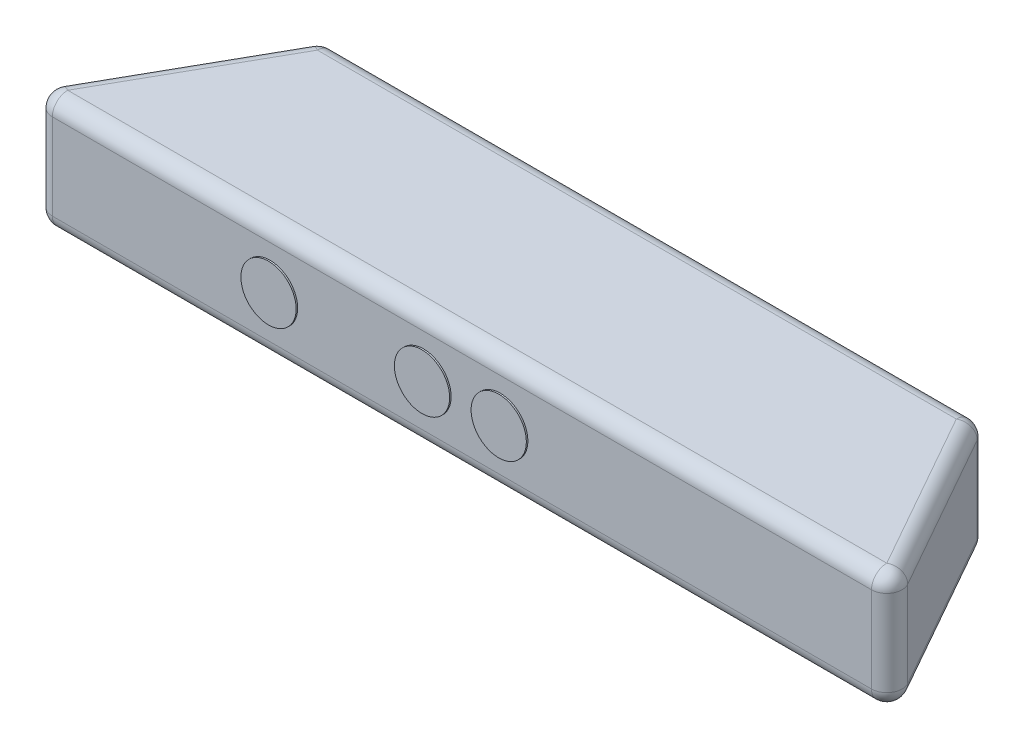
ISO-10303-21;
HEADER;
FILE_DESCRIPTION(('STEP AP214'),'2;1');
FILE_NAME('part.step','',(''),(''),'','','');
FILE_SCHEMA(('AUTOMOTIVE_DESIGN { 1 0 10303 214 1 1 1 1 }'));
ENDSEC;
DATA;
#1=APPLICATION_CONTEXT('core data for automotive mechanical design processes');
#2=APPLICATION_PROTOCOL_DEFINITION('international standard','automotive_design',2000,#1);
#3=PRODUCT_CONTEXT('',#1,'mechanical');
#4=PRODUCT('Part','Part','',(#3));
#5=PRODUCT_RELATED_PRODUCT_CATEGORY('part','',(#4));
#6=PRODUCT_DEFINITION_FORMATION('','',#4);
#7=PRODUCT_DEFINITION_CONTEXT('part definition',#1,'design');
#8=PRODUCT_DEFINITION('design','',#6,#7);
#9=PRODUCT_DEFINITION_SHAPE('','',#8);
#10=(LENGTH_UNIT() NAMED_UNIT(*) SI_UNIT(.MILLI.,.METRE.));
#11=(NAMED_UNIT(*) PLANE_ANGLE_UNIT() SI_UNIT($,.RADIAN.));
#12=(NAMED_UNIT(*) SI_UNIT($,.STERADIAN.) SOLID_ANGLE_UNIT());
#13=UNCERTAINTY_MEASURE_WITH_UNIT(LENGTH_MEASURE(1.E-05),#10,'distance_accuracy_value','');
#14=(GEOMETRIC_REPRESENTATION_CONTEXT(3) GLOBAL_UNCERTAINTY_ASSIGNED_CONTEXT((#13)) GLOBAL_UNIT_ASSIGNED_CONTEXT((#10,
#11,#12)) REPRESENTATION_CONTEXT('',''));
#15=CARTESIAN_POINT('',(0.,0.,0.));
#16=DIRECTION('',(0.,0.,1.));
#17=DIRECTION('',(1.,0.,0.));
#18=AXIS2_PLACEMENT_3D('',#15,#16,#17);
#19=CARTESIAN_POINT('',(-142.,0.,0.));
#20=DIRECTION('',(0.,1.,0.));
#21=DIRECTION('',(0.,0.,1.));
#22=AXIS2_PLACEMENT_3D('',#19,#20,#21);
#23=PLANE('',#22);
#24=CARTESIAN_POINT('',(97.,0.,-17.5000000000002));
#25=DIRECTION('',(0.,-1.,0.));
#26=DIRECTION('',(0.,0.,1.));
#27=AXIS2_PLACEMENT_3D('',#24,#25,#26);
#28=CIRCLE('',#27,3.00000000000001);
#29=CARTESIAN_POINT('',(97.,0.,-14.5000000000001));
#30=VERTEX_POINT('',#29);
#31=EDGE_CURVE('E604',#30,#30,#28,.T.);
#32=ORIENTED_EDGE('',*,*,#31,.F.);
#33=EDGE_LOOP('',(#32));
#34=FACE_BOUND('',#33,.T.);
#35=CARTESIAN_POINT('',(-97.,0.,-17.5));
#36=DIRECTION('',(0.,-1.,0.));
#37=DIRECTION('',(0.,0.,-1.));
#38=AXIS2_PLACEMENT_3D('',#35,#36,#37);
#39=CIRCLE('',#38,3.00000000000001);
#40=CARTESIAN_POINT('',(-97.,0.,-20.5));
#41=VERTEX_POINT('',#40);
#42=EDGE_CURVE('E597',#41,#41,#39,.T.);
#43=ORIENTED_EDGE('',*,*,#42,.F.);
#44=EDGE_LOOP('',(#43));
#45=FACE_BOUND('',#44,.T.);
#46=DIRECTION('',(1.,0.,0.));
#47=VECTOR('',#46,1.);
#48=CARTESIAN_POINT('',(-142.,0.,-5.));
#49=LINE('',#48,#47);
#50=CARTESIAN_POINT('',(133.435733060862,0.,-5.));
#51=VERTEX_POINT('',#50);
#52=CARTESIAN_POINT('',(-133.435733060862,0.,-5.));
#53=VERTEX_POINT('',#52);
#54=EDGE_CURVE('E233',#51,#53,#49,.F.);
#55=ORIENTED_EDGE('',*,*,#54,.T.);
#56=DIRECTION('',(-0.491594368038244,0.,0.870824309096318));
#57=VECTOR('',#56,1.);
#58=CARTESIAN_POINT('',(-137.645878454518,0.,2.45797184019122));
#59=LINE('',#58,#57);
#60=CARTESIAN_POINT('',(-104.080894351185,0.,-57.));
#61=VERTEX_POINT('',#60);
#62=EDGE_CURVE('E242',#53,#61,#59,.F.);
#63=ORIENTED_EDGE('',*,*,#62,.T.);
#64=DIRECTION('',(-1.,0.,0.));
#65=VECTOR('',#64,1.);
#66=CARTESIAN_POINT('',(-142.,0.,-57.));
#67=LINE('',#66,#65);
#68=CARTESIAN_POINT('',(104.080894351185,0.,-57.));
#69=VERTEX_POINT('',#68);
#70=EDGE_CURVE('E239',#61,#69,#67,.F.);
#71=ORIENTED_EDGE('',*,*,#70,.T.);
#72=DIRECTION('',(-0.491594368038244,0.,-0.870824309096318));
#73=VECTOR('',#72,1.);
#74=CARTESIAN_POINT('',(69.013012011433,0.,-119.120248716132));
#75=LINE('',#74,#73);
#76=EDGE_CURVE('E236',#69,#51,#75,.F.);
#77=ORIENTED_EDGE('',*,*,#76,.T.);
#78=EDGE_LOOP('',(#55,#63,#71,#77));
#79=FACE_BOUND('',#78,.T.);
#80=CARTESIAN_POINT('',(0.,0.,-36.2302631578947));
#81=DIRECTION('',(0.,-1.,0.));
#82=DIRECTION('',(0.,0.,-1.));
#83=AXIS2_PLACEMENT_3D('',#80,#81,#82);
#84=CIRCLE('',#83,9.98026315789474);
#85=CARTESIAN_POINT('',(8.50000000000001,0.,-31.));
#86=VERTEX_POINT('',#85);
#87=CARTESIAN_POINT('',(-8.49999999999999,0.,-31.));
#88=VERTEX_POINT('',#87);
#89=EDGE_CURVE('E180',#86,#88,#84,.T.);
#90=ORIENTED_EDGE('',*,*,#89,.F.);
#91=CARTESIAN_POINT('',(0.,0.,-25.7697368421052));
#92=DIRECTION('',(0.,-1.,0.));
#93=DIRECTION('',(0.,0.,1.));
#94=AXIS2_PLACEMENT_3D('',#91,#92,#93);
#95=CIRCLE('',#94,9.98026315789474);
#96=EDGE_CURVE('E177',#88,#86,#95,.T.);
#97=ORIENTED_EDGE('',*,*,#96,.F.);
#98=EDGE_LOOP('',(#90,#97));
#99=FACE_BOUND('',#98,.T.);
#100=ADVANCED_FACE('F43',(#34,#45,#79,#99),#23,.F.);
#101=CARTESIAN_POINT('',(-107.,38.,-62.));
#102=DIRECTION('',(0.870824309096318,0.,0.491594368038244));
#103=DIRECTION('',(0.491594368038244,0.,-0.870824309096318));
#104=AXIS2_PLACEMENT_3D('',#101,#102,#103);
#105=PLANE('',#104);
#106=DIRECTION('',(-0.491594368038244,0.,0.870824309096318));
#107=VECTOR('',#106,1.);
#108=CARTESIAN_POINT('',(-107.,5.,-62.));
#109=LINE('',#108,#107);
#110=CARTESIAN_POINT('',(-108.435015896666,5.,-59.4579718401912));
#111=VERTEX_POINT('',#110);
#112=CARTESIAN_POINT('',(-137.789854606344,5.,-7.45797184019122));
#113=VERTEX_POINT('',#112);
#114=EDGE_CURVE('E200',#111,#113,#109,.T.);
#115=ORIENTED_EDGE('',*,*,#114,.T.);
#116=DIRECTION('',(0.,-1.,0.));
#117=VECTOR('',#116,1.);
#118=CARTESIAN_POINT('',(-137.789854606344,38.,-7.45797184019122));
#119=LINE('',#118,#117);
#120=CARTESIAN_POINT('',(-137.789854606344,33.,-7.45797184019122));
#121=VERTEX_POINT('',#120);
#122=EDGE_CURVE('E206',#113,#121,#119,.F.);
#123=ORIENTED_EDGE('',*,*,#122,.T.);
#124=DIRECTION('',(-0.491594368038244,0.,0.870824309096318));
#125=VECTOR('',#124,1.);
#126=CARTESIAN_POINT('',(-107.,33.,-62.));
#127=LINE('',#126,#125);
#128=CARTESIAN_POINT('',(-108.435015896666,33.,-59.4579718401912));
#129=VERTEX_POINT('',#128);
#130=EDGE_CURVE('E204',#121,#129,#127,.F.);
#131=ORIENTED_EDGE('',*,*,#130,.T.);
#132=DIRECTION('',(0.,-1.,0.));
#133=VECTOR('',#132,1.);
#134=CARTESIAN_POINT('',(-108.435015896666,38.,-59.4579718401912));
#135=LINE('',#134,#133);
#136=EDGE_CURVE('E202',#129,#111,#135,.T.);
#137=ORIENTED_EDGE('',*,*,#136,.T.);
#138=EDGE_LOOP('',(#115,#123,#131,#137));
#139=FACE_BOUND('',#138,.T.);
#140=ADVANCED_FACE('F387',(#139),#105,.F.);
#141=CARTESIAN_POINT('',(-142.,38.,0.));
#142=DIRECTION('',(0.,0.,-1.));
#143=DIRECTION('',(-1.,0.,0.));
#144=AXIS2_PLACEMENT_3D('',#141,#142,#143);
#145=PLANE('',#144);
#146=CARTESIAN_POINT('',(-62.5,19.,0.));
#147=DIRECTION('',(0.,0.,1.));
#148=DIRECTION('',(1.,0.,0.));
#149=AXIS2_PLACEMENT_3D('',#146,#147,#148);
#150=CIRCLE('',#149,9.);
#151=CARTESIAN_POINT('',(-53.5,19.,0.));
#152=VERTEX_POINT('',#151);
#153=EDGE_CURVE('E575',#152,#152,#150,.T.);
#154=ORIENTED_EDGE('',*,*,#153,.F.);
#155=EDGE_LOOP('',(#154));
#156=FACE_BOUND('',#155,.T.);
#157=CARTESIAN_POINT('',(-12.5,19.,0.));
#158=DIRECTION('',(0.,0.,1.));
#159=DIRECTION('',(-1.,0.,0.));
#160=AXIS2_PLACEMENT_3D('',#157,#158,#159);
#161=CIRCLE('',#160,9.);
#162=CARTESIAN_POINT('',(-21.5,19.,0.));
#163=VERTEX_POINT('',#162);
#164=EDGE_CURVE('E566',#163,#163,#161,.T.);
#165=ORIENTED_EDGE('',*,*,#164,.F.);
#166=EDGE_LOOP('',(#165));
#167=FACE_BOUND('',#166,.T.);
#168=CARTESIAN_POINT('',(12.5,19.,0.));
#169=DIRECTION('',(0.,0.,1.));
#170=DIRECTION('',(1.,0.,0.));
#171=AXIS2_PLACEMENT_3D('',#168,#169,#170);
#172=CIRCLE('',#171,9.00000000000001);
#173=CARTESIAN_POINT('',(21.5,19.,0.));
#174=VERTEX_POINT('',#173);
#175=EDGE_CURVE('E565',#174,#174,#172,.T.);
#176=ORIENTED_EDGE('',*,*,#175,.F.);
#177=EDGE_LOOP('',(#176));
#178=FACE_BOUND('',#177,.T.);
#179=DIRECTION('',(1.,0.,0.));
#180=VECTOR('',#179,1.);
#181=CARTESIAN_POINT('',(-142.,33.,0.));
#182=LINE('',#181,#180);
#183=CARTESIAN_POINT('',(133.435733060862,33.,0.));
#184=VERTEX_POINT('',#183);
#185=CARTESIAN_POINT('',(-133.435733060862,33.,0.));
#186=VERTEX_POINT('',#185);
#187=EDGE_CURVE('E194',#184,#186,#182,.F.);
#188=ORIENTED_EDGE('',*,*,#187,.T.);
#189=DIRECTION('',(0.,-1.,0.));
#190=VECTOR('',#189,1.);
#191=CARTESIAN_POINT('',(-133.435733060862,38.,0.));
#192=LINE('',#191,#190);
#193=CARTESIAN_POINT('',(-133.435733060862,5.,0.));
#194=VERTEX_POINT('',#193);
#195=EDGE_CURVE('E197',#186,#194,#192,.T.);
#196=ORIENTED_EDGE('',*,*,#195,.T.);
#197=DIRECTION('',(1.,0.,0.));
#198=VECTOR('',#197,1.);
#199=CARTESIAN_POINT('',(-142.,5.,0.));
#200=LINE('',#199,#198);
#201=CARTESIAN_POINT('',(133.435733060862,5.,0.));
#202=VERTEX_POINT('',#201);
#203=EDGE_CURVE('E182',#194,#202,#200,.T.);
#204=ORIENTED_EDGE('',*,*,#203,.T.);
#205=DIRECTION('',(0.,-1.,0.));
#206=VECTOR('',#205,1.);
#207=CARTESIAN_POINT('',(133.435733060862,38.,0.));
#208=LINE('',#207,#206);
#209=EDGE_CURVE('E187',#202,#184,#208,.F.);
#210=ORIENTED_EDGE('',*,*,#209,.T.);
#211=EDGE_LOOP('',(#188,#196,#204,#210));
#212=FACE_BOUND('',#211,.T.);
#213=ADVANCED_FACE('F393',(#156,#167,#178,#212),#145,.F.);
#214=CARTESIAN_POINT('',(142.,38.,0.));
#215=DIRECTION('',(-0.870824309096318,0.,0.491594368038244));
#216=DIRECTION('',(0.491594368038244,0.,0.870824309096318));
#217=AXIS2_PLACEMENT_3D('',#214,#215,#216);
#218=PLANE('',#217);
#219=DIRECTION('',(0.,-1.,0.));
#220=VECTOR('',#219,1.);
#221=CARTESIAN_POINT('',(108.435015896666,38.,-59.4579718401912));
#222=LINE('',#221,#220);
#223=CARTESIAN_POINT('',(108.435015896666,5.,-59.4579718401912));
#224=VERTEX_POINT('',#223);
#225=CARTESIAN_POINT('',(108.435015896666,33.,-59.4579718401912));
#226=VERTEX_POINT('',#225);
#227=EDGE_CURVE('E63',#224,#226,#222,.F.);
#228=ORIENTED_EDGE('',*,*,#227,.T.);
#229=DIRECTION('',(-0.491594368038244,0.,-0.870824309096318));
#230=VECTOR('',#229,1.);
#231=CARTESIAN_POINT('',(142.,33.,0.));
#232=LINE('',#231,#230);
#233=CARTESIAN_POINT('',(137.789854606344,33.,-7.45797184019122));
#234=VERTEX_POINT('',#233);
#235=EDGE_CURVE('E253',#226,#234,#232,.F.);
#236=ORIENTED_EDGE('',*,*,#235,.T.);
#237=DIRECTION('',(0.,-1.,0.));
#238=VECTOR('',#237,1.);
#239=CARTESIAN_POINT('',(137.789854606344,38.,-7.45797184019122));
#240=LINE('',#239,#238);
#241=CARTESIAN_POINT('',(137.789854606344,5.,-7.45797184019122));
#242=VERTEX_POINT('',#241);
#243=EDGE_CURVE('E248',#234,#242,#240,.T.);
#244=ORIENTED_EDGE('',*,*,#243,.T.);
#245=DIRECTION('',(-0.491594368038244,0.,-0.870824309096318));
#246=VECTOR('',#245,1.);
#247=CARTESIAN_POINT('',(142.,5.,0.));
#248=LINE('',#247,#246);
#249=EDGE_CURVE('E245',#242,#224,#248,.T.);
#250=ORIENTED_EDGE('',*,*,#249,.T.);
#251=EDGE_LOOP('',(#228,#236,#244,#250));
#252=FACE_BOUND('',#251,.T.);
#253=ADVANCED_FACE('F405',(#252),#218,.F.);
#254=CARTESIAN_POINT('',(107.,38.,-62.));
#255=DIRECTION('',(0.,0.,1.));
#256=DIRECTION('',(1.,0.,0.));
#257=AXIS2_PLACEMENT_3D('',#254,#255,#256);
#258=PLANE('',#257);
#259=DIRECTION('',(-1.,0.,0.));
#260=VECTOR('',#259,1.);
#261=CARTESIAN_POINT('',(107.,5.,-62.));
#262=LINE('',#261,#260);
#263=CARTESIAN_POINT('',(104.080894351185,5.,-62.));
#264=VERTEX_POINT('',#263);
#265=CARTESIAN_POINT('',(-104.080894351185,5.,-62.));
#266=VERTEX_POINT('',#265);
#267=EDGE_CURVE('E227',#264,#266,#262,.T.);
#268=ORIENTED_EDGE('',*,*,#267,.T.);
#269=DIRECTION('',(0.,-1.,0.));
#270=VECTOR('',#269,1.);
#271=CARTESIAN_POINT('',(-104.080894351185,38.,-62.));
#272=LINE('',#271,#270);
#273=CARTESIAN_POINT('',(-104.080894351185,33.,-62.));
#274=VERTEX_POINT('',#273);
#275=EDGE_CURVE('E230',#266,#274,#272,.F.);
#276=ORIENTED_EDGE('',*,*,#275,.T.);
#277=DIRECTION('',(-1.,0.,0.));
#278=VECTOR('',#277,1.);
#279=CARTESIAN_POINT('',(107.,33.,-62.));
#280=LINE('',#279,#278);
#281=CARTESIAN_POINT('',(104.080894351185,33.,-62.));
#282=VERTEX_POINT('',#281);
#283=EDGE_CURVE('E224',#274,#282,#280,.F.);
#284=ORIENTED_EDGE('',*,*,#283,.T.);
#285=DIRECTION('',(0.,-1.,0.));
#286=VECTOR('',#285,1.);
#287=CARTESIAN_POINT('',(104.080894351185,38.,-62.));
#288=LINE('',#287,#286);
#289=EDGE_CURVE('E221',#282,#264,#288,.T.);
#290=ORIENTED_EDGE('',*,*,#289,.T.);
#291=EDGE_LOOP('',(#268,#276,#284,#290));
#292=FACE_BOUND('',#291,.T.);
#293=ADVANCED_FACE('F402',(#292),#258,.F.);
#294=CARTESIAN_POINT('',(-142.,38.,0.));
#295=DIRECTION('',(0.,1.,0.));
#296=DIRECTION('',(0.,0.,1.));
#297=AXIS2_PLACEMENT_3D('',#294,#295,#296);
#298=PLANE('',#297);
#299=DIRECTION('',(-1.,0.,0.));
#300=VECTOR('',#299,1.);
#301=CARTESIAN_POINT('',(-107.,38.,-57.));
#302=LINE('',#301,#300);
#303=CARTESIAN_POINT('',(104.080894351185,38.,-57.));
#304=VERTEX_POINT('',#303);
#305=CARTESIAN_POINT('',(-104.080894351185,38.,-57.));
#306=VERTEX_POINT('',#305);
#307=EDGE_CURVE('E215',#304,#306,#302,.T.);
#308=ORIENTED_EDGE('',*,*,#307,.T.);
#309=DIRECTION('',(-0.491594368038244,0.,0.870824309096318));
#310=VECTOR('',#309,1.);
#311=CARTESIAN_POINT('',(-137.645878454518,38.,2.45797184019122));
#312=LINE('',#311,#310);
#313=CARTESIAN_POINT('',(-133.435733060862,38.,-5.));
#314=VERTEX_POINT('',#313);
#315=EDGE_CURVE('E218',#306,#314,#312,.T.);
#316=ORIENTED_EDGE('',*,*,#315,.T.);
#317=DIRECTION('',(1.,0.,0.));
#318=VECTOR('',#317,1.);
#319=CARTESIAN_POINT('',(142.,38.,-5.));
#320=LINE('',#319,#318);
#321=CARTESIAN_POINT('',(133.435733060862,38.,-5.));
#322=VERTEX_POINT('',#321);
#323=EDGE_CURVE('E212',#314,#322,#320,.T.);
#324=ORIENTED_EDGE('',*,*,#323,.T.);
#325=DIRECTION('',(-0.491594368038244,0.,-0.870824309096318));
#326=VECTOR('',#325,1.);
#327=CARTESIAN_POINT('',(102.645878454518,38.,-59.5420281598087));
#328=LINE('',#327,#326);
#329=EDGE_CURVE('E209',#322,#304,#328,.T.);
#330=ORIENTED_EDGE('',*,*,#329,.T.);
#331=EDGE_LOOP('',(#308,#316,#324,#330));
#332=FACE_BOUND('',#331,.T.);
#333=ADVANCED_FACE('F400',(#332),#298,.T.);
#334=CARTESIAN_POINT('',(0.,-10.,-36.2302631578947));
#335=DIRECTION('',(0.,1.,0.));
#336=DIRECTION('',(0.,0.,1.));
#337=AXIS2_PLACEMENT_3D('',#334,#335,#336);
#338=CYLINDRICAL_SURFACE('',#337,9.98026315789474);
#339=ORIENTED_EDGE('',*,*,#89,.T.);
#340=DIRECTION('',(0.,1.,0.));
#341=VECTOR('',#340,1.);
#342=CARTESIAN_POINT('',(-8.49999999999999,-10.,-31.));
#343=LINE('',#342,#341);
#344=CARTESIAN_POINT('',(-8.49999999999999,-10.,-31.));
#345=VERTEX_POINT('',#344);
#346=EDGE_CURVE('E165',#345,#88,#343,.T.);
#347=ORIENTED_EDGE('',*,*,#346,.F.);
#348=CARTESIAN_POINT('',(0.,-10.,-36.2302631578947));
#349=DIRECTION('',(0.,-1.,0.));
#350=DIRECTION('',(0.,0.,-1.));
#351=AXIS2_PLACEMENT_3D('',#348,#349,#350);
#352=CIRCLE('',#351,9.98026315789474);
#353=CARTESIAN_POINT('',(8.50000000000001,-10.,-31.));
#354=VERTEX_POINT('',#353);
#355=EDGE_CURVE('E172',#354,#345,#352,.T.);
#356=ORIENTED_EDGE('',*,*,#355,.F.);
#357=DIRECTION('',(0.,1.,0.));
#358=VECTOR('',#357,1.);
#359=CARTESIAN_POINT('',(8.50000000000001,-10.,-31.));
#360=LINE('',#359,#358);
#361=EDGE_CURVE('E168',#354,#86,#360,.T.);
#362=ORIENTED_EDGE('',*,*,#361,.T.);
#363=EDGE_LOOP('',(#339,#347,#356,#362));
#364=FACE_BOUND('',#363,.T.);
#365=ADVANCED_FACE('F179',(#364),#338,.T.);
#366=CARTESIAN_POINT('',(0.,-10.,-25.7697368421052));
#367=DIRECTION('',(0.,1.,0.));
#368=DIRECTION('',(0.,0.,1.));
#369=AXIS2_PLACEMENT_3D('',#366,#367,#368);
#370=CYLINDRICAL_SURFACE('',#369,9.98026315789474);
#371=ORIENTED_EDGE('',*,*,#96,.T.);
#372=ORIENTED_EDGE('',*,*,#361,.F.);
#373=CARTESIAN_POINT('',(0.,-10.,-25.7697368421052));
#374=DIRECTION('',(0.,-1.,0.));
#375=DIRECTION('',(0.,0.,1.));
#376=AXIS2_PLACEMENT_3D('',#373,#374,#375);
#377=CIRCLE('',#376,9.98026315789474);
#378=EDGE_CURVE('E160',#345,#354,#377,.T.);
#379=ORIENTED_EDGE('',*,*,#378,.F.);
#380=ORIENTED_EDGE('',*,*,#346,.T.);
#381=EDGE_LOOP('',(#371,#372,#379,#380));
#382=FACE_BOUND('',#381,.T.);
#383=ADVANCED_FACE('F163',(#382),#370,.T.);
#384=CARTESIAN_POINT('',(0.,-10.,-31.));
#385=DIRECTION('',(0.,-1.,0.));
#386=DIRECTION('',(0.,0.,-1.));
#387=AXIS2_PLACEMENT_3D('',#384,#385,#386);
#388=PLANE('',#387);
#389=ORIENTED_EDGE('',*,*,#355,.T.);
#390=ORIENTED_EDGE('',*,*,#378,.T.);
#391=EDGE_LOOP('',(#389,#390));
#392=FACE_BOUND('',#391,.T.);
#393=ADVANCED_FACE('F174',(#392),#388,.T.);
#394=CARTESIAN_POINT('',(104.080894351185,38.,-57.));
#395=DIRECTION('',(0.,-1.,0.));
#396=DIRECTION('',(0.,0.,-1.));
#397=AXIS2_PLACEMENT_3D('',#394,#395,#396);
#398=CYLINDRICAL_SURFACE('',#397,5.);
#399=CARTESIAN_POINT('',(104.080894351185,33.,-57.));
#400=DIRECTION('',(0.,1.,0.));
#401=DIRECTION('',(0.,0.,1.));
#402=AXIS2_PLACEMENT_3D('',#399,#400,#401);
#403=CIRCLE('',#402,5.);
#404=EDGE_CURVE('E327',#226,#282,#403,.T.);
#405=ORIENTED_EDGE('',*,*,#404,.F.);
#406=ORIENTED_EDGE('',*,*,#227,.F.);
#407=CARTESIAN_POINT('',(104.080894351185,5.,-57.));
#408=DIRECTION('',(0.,-1.,0.));
#409=DIRECTION('',(0.,0.,-1.));
#410=AXIS2_PLACEMENT_3D('',#407,#408,#409);
#411=CIRCLE('',#410,5.);
#412=EDGE_CURVE('E323',#264,#224,#411,.T.);
#413=ORIENTED_EDGE('',*,*,#412,.F.);
#414=ORIENTED_EDGE('',*,*,#289,.F.);
#415=EDGE_LOOP('',(#405,#406,#413,#414));
#416=FACE_BOUND('',#415,.T.);
#417=ADVANCED_FACE('F45',(#416),#398,.T.);
#418=CARTESIAN_POINT('',(104.080894351185,33.,-57.));
#419=DIRECTION('',(0.,0.,1.));
#420=DIRECTION('',(1.,0.,0.));
#421=AXIS2_PLACEMENT_3D('',#418,#419,#420);
#422=SPHERICAL_SURFACE('',#421,5.);
#423=CARTESIAN_POINT('',(104.080894351185,33.,-57.));
#424=DIRECTION('',(-0.491594368038246,0.,-0.870824309096317));
#425=DIRECTION('',(-0.870824309096317,0.,0.491594368038246));
#426=AXIS2_PLACEMENT_3D('',#423,#424,#425);
#427=CIRCLE('',#426,5.);
#428=EDGE_CURVE('E315',#226,#304,#427,.F.);
#429=ORIENTED_EDGE('',*,*,#428,.F.);
#430=ORIENTED_EDGE('',*,*,#404,.T.);
#431=CARTESIAN_POINT('',(104.080894351185,33.,-57.));
#432=DIRECTION('',(1.,0.,0.));
#433=DIRECTION('',(0.,1.,0.));
#434=AXIS2_PLACEMENT_3D('',#431,#432,#433);
#435=CIRCLE('',#434,5.);
#436=EDGE_CURVE('E319',#304,#282,#435,.F.);
#437=ORIENTED_EDGE('',*,*,#436,.F.);
#438=EDGE_LOOP('',(#429,#430,#437));
#439=FACE_BOUND('',#438,.T.);
#440=ADVANCED_FACE('F476',(#439),#422,.T.);
#441=CARTESIAN_POINT('',(104.080894351185,5.,-57.));
#442=DIRECTION('',(0.,0.,1.));
#443=DIRECTION('',(1.,0.,0.));
#444=AXIS2_PLACEMENT_3D('',#441,#442,#443);
#445=SPHERICAL_SURFACE('',#444,5.);
#446=CARTESIAN_POINT('',(104.080894351185,5.,-57.));
#447=DIRECTION('',(1.,0.,0.));
#448=DIRECTION('',(0.,0.,-1.));
#449=AXIS2_PLACEMENT_3D('',#446,#447,#448);
#450=CIRCLE('',#449,5.);
#451=EDGE_CURVE('E307',#264,#69,#450,.F.);
#452=ORIENTED_EDGE('',*,*,#451,.F.);
#453=ORIENTED_EDGE('',*,*,#412,.T.);
#454=CARTESIAN_POINT('',(104.080894351185,5.,-57.));
#455=DIRECTION('',(-0.491594368038243,0.,-0.870824309096318));
#456=DIRECTION('',(-0.870824309096318,0.,0.491594368038243));
#457=AXIS2_PLACEMENT_3D('',#454,#455,#456);
#458=CIRCLE('',#457,5.);
#459=EDGE_CURVE('E311',#69,#224,#458,.F.);
#460=ORIENTED_EDGE('',*,*,#459,.F.);
#461=EDGE_LOOP('',(#452,#453,#460));
#462=FACE_BOUND('',#461,.T.);
#463=ADVANCED_FACE('F473',(#462),#445,.T.);
#464=CARTESIAN_POINT('',(-142.,33.,-57.));
#465=DIRECTION('',(1.,0.,0.));
#466=DIRECTION('',(0.,0.,-1.));
#467=AXIS2_PLACEMENT_3D('',#464,#465,#466);
#468=CYLINDRICAL_SURFACE('',#467,5.);
#469=ORIENTED_EDGE('',*,*,#436,.T.);
#470=ORIENTED_EDGE('',*,*,#283,.F.);
#471=CARTESIAN_POINT('',(-104.080894351185,33.,-57.));
#472=DIRECTION('',(-1.,0.,0.));
#473=DIRECTION('',(0.,0.,1.));
#474=AXIS2_PLACEMENT_3D('',#471,#472,#473);
#475=CIRCLE('',#474,5.);
#476=EDGE_CURVE('E302',#306,#274,#475,.T.);
#477=ORIENTED_EDGE('',*,*,#476,.F.);
#478=ORIENTED_EDGE('',*,*,#307,.F.);
#479=EDGE_LOOP('',(#469,#470,#477,#478));
#480=FACE_BOUND('',#479,.T.);
#481=ADVANCED_FACE('F469',(#480),#468,.T.);
#482=CARTESIAN_POINT('',(69.013012011433,33.,-119.120248716132));
#483=DIRECTION('',(0.491594368038244,0.,0.870824309096318));
#484=DIRECTION('',(0.870824309096318,0.,-0.491594368038244));
#485=AXIS2_PLACEMENT_3D('',#482,#483,#484);
#486=CYLINDRICAL_SURFACE('',#485,5.);
#487=ORIENTED_EDGE('',*,*,#428,.T.);
#488=ORIENTED_EDGE('',*,*,#329,.F.);
#489=CARTESIAN_POINT('',(133.435733060862,33.,-5.));
#490=DIRECTION('',(0.491594368038244,0.,0.870824309096318));
#491=DIRECTION('',(0.870824309096318,0.,-0.491594368038244));
#492=AXIS2_PLACEMENT_3D('',#489,#490,#491);
#493=CIRCLE('',#492,5.);
#494=EDGE_CURVE('E299',#234,#322,#493,.T.);
#495=ORIENTED_EDGE('',*,*,#494,.F.);
#496=ORIENTED_EDGE('',*,*,#235,.F.);
#497=EDGE_LOOP('',(#487,#488,#495,#496));
#498=FACE_BOUND('',#497,.T.);
#499=ADVANCED_FACE('F465',(#498),#486,.T.);
#500=CARTESIAN_POINT('',(133.435733060862,38.,-5.));
#501=DIRECTION('',(0.,-1.,0.));
#502=DIRECTION('',(0.,0.,-1.));
#503=AXIS2_PLACEMENT_3D('',#500,#501,#502);
#504=CYLINDRICAL_SURFACE('',#503,5.);
#505=CARTESIAN_POINT('',(133.435733060862,5.,-5.));
#506=DIRECTION('',(0.,-1.,0.));
#507=DIRECTION('',(0.,0.,-1.));
#508=AXIS2_PLACEMENT_3D('',#505,#506,#507);
#509=CIRCLE('',#508,5.);
#510=EDGE_CURVE('E294',#242,#202,#509,.T.);
#511=ORIENTED_EDGE('',*,*,#510,.F.);
#512=ORIENTED_EDGE('',*,*,#243,.F.);
#513=CARTESIAN_POINT('',(133.435733060862,33.,-5.));
#514=DIRECTION('',(0.,1.,0.));
#515=DIRECTION('',(0.,0.,1.));
#516=AXIS2_PLACEMENT_3D('',#513,#514,#515);
#517=CIRCLE('',#516,5.);
#518=EDGE_CURVE('E74',#184,#234,#517,.T.);
#519=ORIENTED_EDGE('',*,*,#518,.F.);
#520=ORIENTED_EDGE('',*,*,#209,.F.);
#521=EDGE_LOOP('',(#511,#512,#519,#520));
#522=FACE_BOUND('',#521,.T.);
#523=ADVANCED_FACE('F461',(#522),#504,.T.);
#524=CARTESIAN_POINT('',(137.645878454518,5.,2.45797184019122));
#525=DIRECTION('',(-0.491594368038244,0.,-0.870824309096318));
#526=DIRECTION('',(-0.870824309096318,0.,0.491594368038244));
#527=AXIS2_PLACEMENT_3D('',#524,#525,#526);
#528=CYLINDRICAL_SURFACE('',#527,5.);
#529=ORIENTED_EDGE('',*,*,#459,.T.);
#530=ORIENTED_EDGE('',*,*,#249,.F.);
#531=CARTESIAN_POINT('',(133.435733060862,5.,-5.));
#532=DIRECTION('',(0.491594368038244,0.,0.870824309096318));
#533=DIRECTION('',(0.870824309096318,0.,-0.491594368038244));
#534=AXIS2_PLACEMENT_3D('',#531,#532,#533);
#535=CIRCLE('',#534,5.);
#536=EDGE_CURVE('E291',#51,#242,#535,.T.);
#537=ORIENTED_EDGE('',*,*,#536,.F.);
#538=ORIENTED_EDGE('',*,*,#76,.F.);
#539=EDGE_LOOP('',(#529,#530,#537,#538));
#540=FACE_BOUND('',#539,.T.);
#541=ADVANCED_FACE('F457',(#540),#528,.T.);
#542=CARTESIAN_POINT('',(107.,5.,-57.));
#543=DIRECTION('',(-1.,0.,0.));
#544=DIRECTION('',(0.,0.,1.));
#545=AXIS2_PLACEMENT_3D('',#542,#543,#544);
#546=CYLINDRICAL_SURFACE('',#545,5.);
#547=ORIENTED_EDGE('',*,*,#451,.T.);
#548=ORIENTED_EDGE('',*,*,#70,.F.);
#549=CARTESIAN_POINT('',(-104.080894351185,5.,-57.));
#550=DIRECTION('',(-1.,0.,0.));
#551=DIRECTION('',(0.,0.,1.));
#552=AXIS2_PLACEMENT_3D('',#549,#550,#551);
#553=CIRCLE('',#552,5.);
#554=EDGE_CURVE('E288',#266,#61,#553,.T.);
#555=ORIENTED_EDGE('',*,*,#554,.F.);
#556=ORIENTED_EDGE('',*,*,#267,.F.);
#557=EDGE_LOOP('',(#547,#548,#555,#556));
#558=FACE_BOUND('',#557,.T.);
#559=ADVANCED_FACE('F453',(#558),#546,.T.);
#560=CARTESIAN_POINT('',(-104.080894351185,38.,-57.));
#561=DIRECTION('',(0.,-1.,0.));
#562=DIRECTION('',(0.,0.,-1.));
#563=AXIS2_PLACEMENT_3D('',#560,#561,#562);
#564=CYLINDRICAL_SURFACE('',#563,5.);
#565=CARTESIAN_POINT('',(-104.080894351185,33.,-57.));
#566=DIRECTION('',(0.,1.,0.));
#567=DIRECTION('',(0.,0.,1.));
#568=AXIS2_PLACEMENT_3D('',#565,#566,#567);
#569=CIRCLE('',#568,5.);
#570=EDGE_CURVE('E304',#274,#129,#569,.T.);
#571=ORIENTED_EDGE('',*,*,#570,.F.);
#572=ORIENTED_EDGE('',*,*,#275,.F.);
#573=CARTESIAN_POINT('',(-104.080894351185,5.,-57.));
#574=DIRECTION('',(0.,-1.,0.));
#575=DIRECTION('',(0.,0.,-1.));
#576=AXIS2_PLACEMENT_3D('',#573,#574,#575);
#577=CIRCLE('',#576,5.);
#578=EDGE_CURVE('E285',#111,#266,#577,.T.);
#579=ORIENTED_EDGE('',*,*,#578,.F.);
#580=ORIENTED_EDGE('',*,*,#136,.F.);
#581=EDGE_LOOP('',(#571,#572,#579,#580));
#582=FACE_BOUND('',#581,.T.);
#583=ADVANCED_FACE('F449',(#582),#564,.T.);
#584=CARTESIAN_POINT('',(-104.080894351185,33.,-57.));
#585=DIRECTION('',(0.,0.,1.));
#586=DIRECTION('',(1.,0.,0.));
#587=AXIS2_PLACEMENT_3D('',#584,#585,#586);
#588=SPHERICAL_SURFACE('',#587,5.);
#589=ORIENTED_EDGE('',*,*,#476,.T.);
#590=ORIENTED_EDGE('',*,*,#570,.T.);
#591=CARTESIAN_POINT('',(-104.080894351185,33.,-57.));
#592=DIRECTION('',(0.491594368038243,0.,-0.870824309096318));
#593=DIRECTION('',(-0.870824309096318,0.,-0.491594368038243));
#594=AXIS2_PLACEMENT_3D('',#591,#592,#593);
#595=CIRCLE('',#594,5.);
#596=EDGE_CURVE('E282',#306,#129,#595,.F.);
#597=ORIENTED_EDGE('',*,*,#596,.F.);
#598=EDGE_LOOP('',(#589,#590,#597));
#599=FACE_BOUND('',#598,.T.);
#600=ADVANCED_FACE('F446',(#599),#588,.T.);
#601=CARTESIAN_POINT('',(133.435733060862,33.,-5.));
#602=DIRECTION('',(0.,0.,1.));
#603=DIRECTION('',(1.,0.,0.));
#604=AXIS2_PLACEMENT_3D('',#601,#602,#603);
#605=SPHERICAL_SURFACE('',#604,5.);
#606=ORIENTED_EDGE('',*,*,#518,.T.);
#607=ORIENTED_EDGE('',*,*,#494,.T.);
#608=CARTESIAN_POINT('',(133.435733060862,33.,-5.));
#609=DIRECTION('',(1.,0.,0.));
#610=DIRECTION('',(0.,0.,-1.));
#611=AXIS2_PLACEMENT_3D('',#608,#609,#610);
#612=CIRCLE('',#611,5.);
#613=EDGE_CURVE('E278',#184,#322,#612,.F.);
#614=ORIENTED_EDGE('',*,*,#613,.F.);
#615=EDGE_LOOP('',(#606,#607,#614));
#616=FACE_BOUND('',#615,.T.);
#617=ADVANCED_FACE('F442',(#616),#605,.T.);
#618=CARTESIAN_POINT('',(133.435733060862,5.,-5.));
#619=DIRECTION('',(0.,0.,1.));
#620=DIRECTION('',(1.,0.,0.));
#621=AXIS2_PLACEMENT_3D('',#618,#619,#620);
#622=SPHERICAL_SURFACE('',#621,5.);
#623=ORIENTED_EDGE('',*,*,#536,.T.);
#624=ORIENTED_EDGE('',*,*,#510,.T.);
#625=CARTESIAN_POINT('',(133.435733060862,5.,-5.));
#626=DIRECTION('',(1.,0.,0.));
#627=DIRECTION('',(0.,0.,-1.));
#628=AXIS2_PLACEMENT_3D('',#625,#626,#627);
#629=CIRCLE('',#628,5.);
#630=EDGE_CURVE('E275',#51,#202,#629,.F.);
#631=ORIENTED_EDGE('',*,*,#630,.F.);
#632=EDGE_LOOP('',(#623,#624,#631));
#633=FACE_BOUND('',#632,.T.);
#634=ADVANCED_FACE('F438',(#633),#622,.T.);
#635=CARTESIAN_POINT('',(-104.080894351185,5.,-57.));
#636=DIRECTION('',(0.,0.,1.));
#637=DIRECTION('',(1.,0.,0.));
#638=AXIS2_PLACEMENT_3D('',#635,#636,#637);
#639=SPHERICAL_SURFACE('',#638,5.);
#640=ORIENTED_EDGE('',*,*,#578,.T.);
#641=ORIENTED_EDGE('',*,*,#554,.T.);
#642=CARTESIAN_POINT('',(-104.080894351185,5.,-57.));
#643=DIRECTION('',(0.491594368038244,0.,-0.870824309096318));
#644=DIRECTION('',(-0.870824309096318,0.,-0.491594368038244));
#645=AXIS2_PLACEMENT_3D('',#642,#643,#644);
#646=CIRCLE('',#645,5.);
#647=EDGE_CURVE('E273',#111,#61,#646,.F.);
#648=ORIENTED_EDGE('',*,*,#647,.F.);
#649=EDGE_LOOP('',(#640,#641,#648));
#650=FACE_BOUND('',#649,.T.);
#651=ADVANCED_FACE('F434',(#650),#639,.T.);
#652=CARTESIAN_POINT('',(-137.645878454518,33.,2.45797184019122));
#653=DIRECTION('',(0.491594368038244,0.,-0.870824309096318));
#654=DIRECTION('',(-0.870824309096318,0.,-0.491594368038244));
#655=AXIS2_PLACEMENT_3D('',#652,#653,#654);
#656=CYLINDRICAL_SURFACE('',#655,5.);
#657=ORIENTED_EDGE('',*,*,#596,.T.);
#658=ORIENTED_EDGE('',*,*,#130,.F.);
#659=CARTESIAN_POINT('',(-133.435733060862,33.,-5.));
#660=DIRECTION('',(-0.491594368038244,0.,0.870824309096318));
#661=DIRECTION('',(0.870824309096318,0.,0.491594368038244));
#662=AXIS2_PLACEMENT_3D('',#659,#660,#661);
#663=CIRCLE('',#662,5.);
#664=EDGE_CURVE('E270',#314,#121,#663,.T.);
#665=ORIENTED_EDGE('',*,*,#664,.F.);
#666=ORIENTED_EDGE('',*,*,#315,.F.);
#667=EDGE_LOOP('',(#657,#658,#665,#666));
#668=FACE_BOUND('',#667,.T.);
#669=ADVANCED_FACE('F430',(#668),#656,.T.);
#670=CARTESIAN_POINT('',(-142.,33.,-5.));
#671=DIRECTION('',(-1.,0.,0.));
#672=DIRECTION('',(0.,0.,1.));
#673=AXIS2_PLACEMENT_3D('',#670,#671,#672);
#674=CYLINDRICAL_SURFACE('',#673,5.);
#675=ORIENTED_EDGE('',*,*,#613,.T.);
#676=ORIENTED_EDGE('',*,*,#323,.F.);
#677=CARTESIAN_POINT('',(-133.435733060862,33.,-5.));
#678=DIRECTION('',(-1.,0.,0.));
#679=DIRECTION('',(0.,0.,1.));
#680=AXIS2_PLACEMENT_3D('',#677,#678,#679);
#681=CIRCLE('',#680,5.);
#682=EDGE_CURVE('E268',#186,#314,#681,.T.);
#683=ORIENTED_EDGE('',*,*,#682,.F.);
#684=ORIENTED_EDGE('',*,*,#187,.F.);
#685=EDGE_LOOP('',(#675,#676,#683,#684));
#686=FACE_BOUND('',#685,.T.);
#687=ADVANCED_FACE('F426',(#686),#674,.T.);
#688=CARTESIAN_POINT('',(-142.,5.,-5.));
#689=DIRECTION('',(1.,0.,0.));
#690=DIRECTION('',(0.,0.,-1.));
#691=AXIS2_PLACEMENT_3D('',#688,#689,#690);
#692=CYLINDRICAL_SURFACE('',#691,5.);
#693=ORIENTED_EDGE('',*,*,#630,.T.);
#694=ORIENTED_EDGE('',*,*,#203,.F.);
#695=CARTESIAN_POINT('',(-133.435733060862,5.,-5.));
#696=DIRECTION('',(-1.,0.,0.));
#697=DIRECTION('',(0.,0.,1.));
#698=AXIS2_PLACEMENT_3D('',#695,#696,#697);
#699=CIRCLE('',#698,5.);
#700=EDGE_CURVE('E265',#53,#194,#699,.T.);
#701=ORIENTED_EDGE('',*,*,#700,.F.);
#702=ORIENTED_EDGE('',*,*,#54,.F.);
#703=EDGE_LOOP('',(#693,#694,#701,#702));
#704=FACE_BOUND('',#703,.T.);
#705=ADVANCED_FACE('F422',(#704),#692,.T.);
#706=CARTESIAN_POINT('',(-102.645878454518,5.,-59.5420281598088));
#707=DIRECTION('',(-0.491594368038244,0.,0.870824309096318));
#708=DIRECTION('',(0.870824309096318,0.,0.491594368038244));
#709=AXIS2_PLACEMENT_3D('',#706,#707,#708);
#710=CYLINDRICAL_SURFACE('',#709,5.);
#711=ORIENTED_EDGE('',*,*,#647,.T.);
#712=ORIENTED_EDGE('',*,*,#62,.F.);
#713=CARTESIAN_POINT('',(-133.435733060862,5.,-5.));
#714=DIRECTION('',(-0.491594368038244,0.,0.870824309096318));
#715=DIRECTION('',(0.870824309096318,0.,0.491594368038244));
#716=AXIS2_PLACEMENT_3D('',#713,#714,#715);
#717=CIRCLE('',#716,5.);
#718=EDGE_CURVE('E262',#113,#53,#717,.T.);
#719=ORIENTED_EDGE('',*,*,#718,.F.);
#720=ORIENTED_EDGE('',*,*,#114,.F.);
#721=EDGE_LOOP('',(#711,#712,#719,#720));
#722=FACE_BOUND('',#721,.T.);
#723=ADVANCED_FACE('F418',(#722),#710,.T.);
#724=CARTESIAN_POINT('',(-133.435733060862,33.,-5.));
#725=DIRECTION('',(0.,0.,1.));
#726=DIRECTION('',(1.,0.,0.));
#727=AXIS2_PLACEMENT_3D('',#724,#725,#726);
#728=SPHERICAL_SURFACE('',#727,5.);
#729=ORIENTED_EDGE('',*,*,#682,.T.);
#730=ORIENTED_EDGE('',*,*,#664,.T.);
#731=CARTESIAN_POINT('',(-133.435733060862,33.,-5.));
#732=DIRECTION('',(0.,1.,0.));
#733=DIRECTION('',(0.,0.,1.));
#734=AXIS2_PLACEMENT_3D('',#731,#732,#733);
#735=CIRCLE('',#734,5.);
#736=EDGE_CURVE('E259',#186,#121,#735,.F.);
#737=ORIENTED_EDGE('',*,*,#736,.F.);
#738=EDGE_LOOP('',(#729,#730,#737));
#739=FACE_BOUND('',#738,.T.);
#740=ADVANCED_FACE('F414',(#739),#728,.T.);
#741=CARTESIAN_POINT('',(-133.435733060862,5.,-5.));
#742=DIRECTION('',(0.,0.,1.));
#743=DIRECTION('',(1.,0.,0.));
#744=AXIS2_PLACEMENT_3D('',#741,#742,#743);
#745=SPHERICAL_SURFACE('',#744,5.);
#746=ORIENTED_EDGE('',*,*,#718,.T.);
#747=ORIENTED_EDGE('',*,*,#700,.T.);
#748=CARTESIAN_POINT('',(-133.435733060862,5.,-5.));
#749=DIRECTION('',(0.,-1.,0.));
#750=DIRECTION('',(0.,0.,-1.));
#751=AXIS2_PLACEMENT_3D('',#748,#749,#750);
#752=CIRCLE('',#751,5.);
#753=EDGE_CURVE('E257',#113,#194,#752,.F.);
#754=ORIENTED_EDGE('',*,*,#753,.F.);
#755=EDGE_LOOP('',(#746,#747,#754));
#756=FACE_BOUND('',#755,.T.);
#757=ADVANCED_FACE('F381',(#756),#745,.T.);
#758=CARTESIAN_POINT('',(-133.435733060862,38.,-5.));
#759=DIRECTION('',(0.,-1.,0.));
#760=DIRECTION('',(0.,0.,-1.));
#761=AXIS2_PLACEMENT_3D('',#758,#759,#760);
#762=CYLINDRICAL_SURFACE('',#761,5.);
#763=ORIENTED_EDGE('',*,*,#736,.T.);
#764=ORIENTED_EDGE('',*,*,#122,.F.);
#765=ORIENTED_EDGE('',*,*,#753,.T.);
#766=ORIENTED_EDGE('',*,*,#195,.F.);
#767=EDGE_LOOP('',(#763,#764,#765,#766));
#768=FACE_BOUND('',#767,.T.);
#769=ADVANCED_FACE('F376',(#768),#762,.T.);
#770=CARTESIAN_POINT('',(12.5,19.,-0.5));
#771=DIRECTION('',(0.,0.,1.));
#772=DIRECTION('',(1.,0.,0.));
#773=AXIS2_PLACEMENT_3D('',#770,#771,#772);
#774=CYLINDRICAL_SURFACE('',#773,9.00000000000001);
#775=CARTESIAN_POINT('',(12.5,19.,0.5));
#776=DIRECTION('',(0.,0.,1.));
#777=DIRECTION('',(1.,0.,0.));
#778=AXIS2_PLACEMENT_3D('',#775,#776,#777);
#779=CIRCLE('',#778,9.00000000000001);
#780=CARTESIAN_POINT('',(21.5,19.,0.5));
#781=VERTEX_POINT('',#780);
#782=EDGE_CURVE('E585',#781,#781,#779,.F.);
#783=ORIENTED_EDGE('',*,*,#782,.T.);
#784=EDGE_LOOP('',(#783));
#785=FACE_BOUND('',#784,.T.);
#786=ORIENTED_EDGE('',*,*,#175,.T.);
#787=EDGE_LOOP('',(#786));
#788=FACE_BOUND('',#787,.T.);
#789=ADVANCED_FACE('F373',(#785,#788),#774,.T.);
#790=CARTESIAN_POINT('',(0.,-189.858094277029,0.5));
#791=DIRECTION('',(0.,0.,1.));
#792=DIRECTION('',(1.,0.,0.));
#793=AXIS2_PLACEMENT_3D('',#790,#791,#792);
#794=PLANE('',#793);
#795=ORIENTED_EDGE('',*,*,#782,.F.);
#796=EDGE_LOOP('',(#795));
#797=FACE_BOUND('',#796,.T.);
#798=ADVANCED_FACE('F369',(#797),#794,.T.);
#799=CARTESIAN_POINT('',(-62.5,19.,-0.5));
#800=DIRECTION('',(0.,0.,1.));
#801=DIRECTION('',(1.,0.,0.));
#802=AXIS2_PLACEMENT_3D('',#799,#800,#801);
#803=CYLINDRICAL_SURFACE('',#802,9.);
#804=CARTESIAN_POINT('',(-62.5,19.,0.5));
#805=DIRECTION('',(0.,0.,1.));
#806=DIRECTION('',(1.,0.,0.));
#807=AXIS2_PLACEMENT_3D('',#804,#805,#806);
#808=CIRCLE('',#807,9.);
#809=CARTESIAN_POINT('',(-53.5,19.,0.5));
#810=VERTEX_POINT('',#809);
#811=EDGE_CURVE('E589',#810,#810,#808,.T.);
#812=ORIENTED_EDGE('',*,*,#811,.F.);
#813=EDGE_LOOP('',(#812));
#814=FACE_BOUND('',#813,.T.);
#815=ORIENTED_EDGE('',*,*,#153,.T.);
#816=EDGE_LOOP('',(#815));
#817=FACE_BOUND('',#816,.T.);
#818=ADVANCED_FACE('F372',(#814,#817),#803,.T.);
#819=CARTESIAN_POINT('',(-62.5,19.,0.5));
#820=DIRECTION('',(0.,0.,1.));
#821=DIRECTION('',(1.,0.,0.));
#822=AXIS2_PLACEMENT_3D('',#819,#820,#821);
#823=PLANE('',#822);
#824=ORIENTED_EDGE('',*,*,#811,.T.);
#825=EDGE_LOOP('',(#824));
#826=FACE_BOUND('',#825,.T.);
#827=ADVANCED_FACE('F362',(#826),#823,.T.);
#828=CARTESIAN_POINT('',(-12.5,19.,-0.5));
#829=DIRECTION('',(0.,0.,1.));
#830=DIRECTION('',(1.,0.,0.));
#831=AXIS2_PLACEMENT_3D('',#828,#829,#830);
#832=CYLINDRICAL_SURFACE('',#831,9.00000000000001);
#833=CARTESIAN_POINT('',(-12.5,19.,0.5));
#834=DIRECTION('',(0.,0.,1.));
#835=DIRECTION('',(1.,0.,0.));
#836=AXIS2_PLACEMENT_3D('',#833,#834,#835);
#837=CIRCLE('',#836,9.00000000000001);
#838=CARTESIAN_POINT('',(-3.5,19.,0.5));
#839=VERTEX_POINT('',#838);
#840=EDGE_CURVE('E592',#839,#839,#837,.T.);
#841=ORIENTED_EDGE('',*,*,#840,.F.);
#842=EDGE_LOOP('',(#841));
#843=FACE_BOUND('',#842,.T.);
#844=ORIENTED_EDGE('',*,*,#164,.T.);
#845=EDGE_LOOP('',(#844));
#846=FACE_BOUND('',#845,.T.);
#847=ADVANCED_FACE('F630',(#843,#846),#832,.T.);
#848=CARTESIAN_POINT('',(-12.5,19.,0.5));
#849=DIRECTION('',(0.,0.,1.));
#850=DIRECTION('',(1.,0.,0.));
#851=AXIS2_PLACEMENT_3D('',#848,#849,#850);
#852=PLANE('',#851);
#853=ORIENTED_EDGE('',*,*,#840,.T.);
#854=EDGE_LOOP('',(#853));
#855=FACE_BOUND('',#854,.T.);
#856=ADVANCED_FACE('F628',(#855),#852,.T.);
#857=CARTESIAN_POINT('',(-97.,2.5,-17.5));
#858=DIRECTION('',(0.,-1.,0.));
#859=DIRECTION('',(0.,0.,-1.));
#860=AXIS2_PLACEMENT_3D('',#857,#858,#859);
#861=CYLINDRICAL_SURFACE('',#860,3.00000000000001);
#862=CARTESIAN_POINT('',(-97.,2.5,-17.5));
#863=DIRECTION('',(0.,-1.,0.));
#864=DIRECTION('',(0.,0.,-1.));
#865=AXIS2_PLACEMENT_3D('',#862,#863,#864);
#866=CIRCLE('',#865,3.00000000000001);
#867=CARTESIAN_POINT('',(-97.,2.5,-20.5));
#868=VERTEX_POINT('',#867);
#869=EDGE_CURVE('E596',#868,#868,#866,.T.);
#870=ORIENTED_EDGE('',*,*,#869,.F.);
#871=EDGE_LOOP('',(#870));
#872=FACE_BOUND('',#871,.T.);
#873=ORIENTED_EDGE('',*,*,#42,.T.);
#874=EDGE_LOOP('',(#873));
#875=FACE_BOUND('',#874,.T.);
#876=ADVANCED_FACE('F622',(#872,#875),#861,.F.);
#877=CARTESIAN_POINT('',(-97.,2.5,-17.5));
#878=DIRECTION('',(0.,-1.,0.));
#879=DIRECTION('',(0.,0.,-1.));
#880=AXIS2_PLACEMENT_3D('',#877,#878,#879);
#881=PLANE('',#880);
#882=ORIENTED_EDGE('',*,*,#869,.T.);
#883=EDGE_LOOP('',(#882));
#884=FACE_BOUND('',#883,.T.);
#885=ADVANCED_FACE('F615',(#884),#881,.T.);
#886=CARTESIAN_POINT('',(97.,2.5,-17.5000000000002));
#887=DIRECTION('',(0.,-1.,0.));
#888=DIRECTION('',(0.,0.,-1.));
#889=AXIS2_PLACEMENT_3D('',#886,#887,#888);
#890=CYLINDRICAL_SURFACE('',#889,3.00000000000001);
#891=CARTESIAN_POINT('',(97.,2.5,-17.5000000000002));
#892=DIRECTION('',(0.,-1.,0.));
#893=DIRECTION('',(0.,0.,1.));
#894=AXIS2_PLACEMENT_3D('',#891,#892,#893);
#895=CIRCLE('',#894,3.00000000000001);
#896=CARTESIAN_POINT('',(97.,2.5,-14.5000000000001));
#897=VERTEX_POINT('',#896);
#898=EDGE_CURVE('E601',#897,#897,#895,.T.);
#899=ORIENTED_EDGE('',*,*,#898,.F.);
#900=EDGE_LOOP('',(#899));
#901=FACE_BOUND('',#900,.T.);
#902=ORIENTED_EDGE('',*,*,#31,.T.);
#903=EDGE_LOOP('',(#902));
#904=FACE_BOUND('',#903,.T.);
#905=ADVANCED_FACE('F612',(#901,#904),#890,.F.);
#906=CARTESIAN_POINT('',(97.,2.5,-17.5000000000002));
#907=DIRECTION('',(0.,1.,0.));
#908=DIRECTION('',(0.,0.,1.));
#909=AXIS2_PLACEMENT_3D('',#906,#907,#908);
#910=PLANE('',#909);
#911=ORIENTED_EDGE('',*,*,#898,.T.);
#912=EDGE_LOOP('',(#911));
#913=FACE_BOUND('',#912,.T.);
#914=ADVANCED_FACE('F610',(#913),#910,.F.);
#915=CLOSED_SHELL('',(#100,#140,#213,#253,#293,#333,#365,#383,#393,#417,#440,#463,#481,#499,
#523,#541,#559,#583,#600,#617,#634,#651,#669,#687,#705,#723,#740,#757,#769,#789,#798,#818,#827,
#847,#856,#876,#885,#905,#914));
#916=CARTESIAN_POINT('',(-12.5,19.,-0.5));
#917=DIRECTION('',(0.,0.,1.));
#918=DIRECTION('',(1.,0.,0.));
#919=AXIS2_PLACEMENT_3D('',#916,#917,#918);
#920=PLANE('',#919);
#921=CARTESIAN_POINT('',(-12.5,19.,-0.5));
#922=DIRECTION('',(0.,0.,1.));
#923=DIRECTION('',(1.,0.,0.));
#924=AXIS2_PLACEMENT_3D('',#921,#922,#923);
#925=CIRCLE('',#924,9.);
#926=CARTESIAN_POINT('',(-3.5,19.,-0.5));
#927=VERTEX_POINT('',#926);
#928=EDGE_CURVE('E11',#927,#927,#925,.F.);
#929=ORIENTED_EDGE('',*,*,#928,.T.);
#930=EDGE_LOOP('',(#929));
#931=FACE_BOUND('',#930,.T.);
#932=ADVANCED_FACE('F554',(#931),#920,.F.);
#933=CARTESIAN_POINT('',(-12.5,19.,-5.));
#934=DIRECTION('',(0.,0.,-1.));
#935=DIRECTION('',(-1.,0.,0.));
#936=AXIS2_PLACEMENT_3D('',#933,#934,#935);
#937=PLANE('',#936);
#938=CARTESIAN_POINT('',(-12.5,19.,-5.));
#939=DIRECTION('',(0.,0.,1.));
#940=DIRECTION('',(-1.,0.,0.));
#941=AXIS2_PLACEMENT_3D('',#938,#939,#940);
#942=CIRCLE('',#941,9.);
#943=CARTESIAN_POINT('',(-21.5,19.,-5.));
#944=VERTEX_POINT('',#943);
#945=EDGE_CURVE('E563',#944,#944,#942,.T.);
#946=ORIENTED_EDGE('',*,*,#945,.T.);
#947=EDGE_LOOP('',(#946));
#948=FACE_BOUND('',#947,.T.);
#949=ADVANCED_FACE('F550',(#948),#937,.F.);
#950=CARTESIAN_POINT('',(-12.5,19.,-5.));
#951=DIRECTION('',(0.,0.,1.));
#952=DIRECTION('',(1.,0.,0.));
#953=AXIS2_PLACEMENT_3D('',#950,#951,#952);
#954=CYLINDRICAL_SURFACE('',#953,9.);
#955=ORIENTED_EDGE('',*,*,#945,.F.);
#956=EDGE_LOOP('',(#955));
#957=FACE_BOUND('',#956,.T.);
#958=ORIENTED_EDGE('',*,*,#928,.F.);
#959=EDGE_LOOP('',(#958));
#960=FACE_BOUND('',#959,.T.);
#961=ADVANCED_FACE('F549',(#957,#960),#954,.F.);
#962=CLOSED_SHELL('',(#932,#949,#961));
#963=CARTESIAN_POINT('',(-62.5,19.,-0.5));
#964=DIRECTION('',(0.,0.,1.));
#965=DIRECTION('',(1.,0.,0.));
#966=AXIS2_PLACEMENT_3D('',#963,#964,#965);
#967=PLANE('',#966);
#968=CARTESIAN_POINT('',(-62.5,19.,-0.5));
#969=DIRECTION('',(0.,0.,1.));
#970=DIRECTION('',(1.,0.,0.));
#971=AXIS2_PLACEMENT_3D('',#968,#969,#970);
#972=CIRCLE('',#971,9.);
#973=CARTESIAN_POINT('',(-53.5,19.,-0.5));
#974=VERTEX_POINT('',#973);
#975=EDGE_CURVE('E53',#974,#974,#972,.F.);
#976=ORIENTED_EDGE('',*,*,#975,.T.);
#977=EDGE_LOOP('',(#976));
#978=FACE_BOUND('',#977,.T.);
#979=ADVANCED_FACE('F335',(#978),#967,.F.);
#980=CARTESIAN_POINT('',(-62.5,19.,-5.));
#981=DIRECTION('',(0.,0.,1.));
#982=DIRECTION('',(1.,0.,0.));
#983=AXIS2_PLACEMENT_3D('',#980,#981,#982);
#984=PLANE('',#983);
#985=CARTESIAN_POINT('',(-62.5,19.,-5.));
#986=DIRECTION('',(0.,0.,1.));
#987=DIRECTION('',(1.,0.,0.));
#988=AXIS2_PLACEMENT_3D('',#985,#986,#987);
#989=CIRCLE('',#988,9.);
#990=CARTESIAN_POINT('',(-53.5,19.,-5.));
#991=VERTEX_POINT('',#990);
#992=EDGE_CURVE('E572',#991,#991,#989,.T.);
#993=ORIENTED_EDGE('',*,*,#992,.T.);
#994=EDGE_LOOP('',(#993));
#995=FACE_BOUND('',#994,.T.);
#996=ADVANCED_FACE('F339',(#995),#984,.T.);
#997=CARTESIAN_POINT('',(-62.5,19.,-5.));
#998=DIRECTION('',(0.,0.,1.));
#999=DIRECTION('',(1.,0.,0.));
#1000=AXIS2_PLACEMENT_3D('',#997,#998,#999);
#1001=CYLINDRICAL_SURFACE('',#1000,9.);
#1002=ORIENTED_EDGE('',*,*,#992,.F.);
#1003=EDGE_LOOP('',(#1002));
#1004=FACE_BOUND('',#1003,.T.);
#1005=ORIENTED_EDGE('',*,*,#975,.F.);
#1006=EDGE_LOOP('',(#1005));
#1007=FACE_BOUND('',#1006,.T.);
#1008=ADVANCED_FACE('F337',(#1004,#1007),#1001,.F.);
#1009=CLOSED_SHELL('',(#979,#996,#1008));
#1010=CARTESIAN_POINT('',(0.,-189.858094277029,-0.5));
#1011=DIRECTION('',(0.,0.,1.));
#1012=DIRECTION('',(1.,0.,0.));
#1013=AXIS2_PLACEMENT_3D('',#1010,#1011,#1012);
#1014=PLANE('',#1013);
#1015=CARTESIAN_POINT('',(12.5,19.,-0.5));
#1016=DIRECTION('',(0.,0.,1.));
#1017=DIRECTION('',(1.,0.,0.));
#1018=AXIS2_PLACEMENT_3D('',#1015,#1016,#1017);
#1019=CIRCLE('',#1018,9.00000000000001);
#1020=CARTESIAN_POINT('',(21.5,19.,-0.5));
#1021=VERTEX_POINT('',#1020);
#1022=EDGE_CURVE('E256',#1021,#1021,#1019,.F.);
#1023=ORIENTED_EDGE('',*,*,#1022,.T.);
#1024=EDGE_LOOP('',(#1023));
#1025=FACE_BOUND('',#1024,.T.);
#1026=ADVANCED_FACE('F364',(#1025),#1014,.F.);
#1027=CARTESIAN_POINT('',(12.5,19.,-5.));
#1028=DIRECTION('',(0.,0.,1.));
#1029=DIRECTION('',(1.,0.,0.));
#1030=AXIS2_PLACEMENT_3D('',#1027,#1028,#1029);
#1031=PLANE('',#1030);
#1032=CARTESIAN_POINT('',(12.5,19.,-5.));
#1033=DIRECTION('',(0.,0.,1.));
#1034=DIRECTION('',(1.,0.,0.));
#1035=AXIS2_PLACEMENT_3D('',#1032,#1033,#1034);
#1036=CIRCLE('',#1035,9.00000000000001);
#1037=CARTESIAN_POINT('',(21.5,19.,-5.));
#1038=VERTEX_POINT('',#1037);
#1039=EDGE_CURVE('E260',#1038,#1038,#1036,.T.);
#1040=ORIENTED_EDGE('',*,*,#1039,.T.);
#1041=EDGE_LOOP('',(#1040));
#1042=FACE_BOUND('',#1041,.T.);
#1043=ADVANCED_FACE('F366',(#1042),#1031,.T.);
#1044=CARTESIAN_POINT('',(12.5,19.,-5.));
#1045=DIRECTION('',(0.,0.,1.));
#1046=DIRECTION('',(1.,0.,0.));
#1047=AXIS2_PLACEMENT_3D('',#1044,#1045,#1046);
#1048=CYLINDRICAL_SURFACE('',#1047,9.00000000000001);
#1049=ORIENTED_EDGE('',*,*,#1039,.F.);
#1050=EDGE_LOOP('',(#1049));
#1051=FACE_BOUND('',#1050,.T.);
#1052=ORIENTED_EDGE('',*,*,#1022,.F.);
#1053=EDGE_LOOP('',(#1052));
#1054=FACE_BOUND('',#1053,.T.);
#1055=ADVANCED_FACE('F542',(#1051,#1054),#1048,.F.);
#1056=CLOSED_SHELL('',(#1026,#1043,#1055));
#1057=ORIENTED_CLOSED_SHELL('',*,#962,.T.);
#1058=ORIENTED_CLOSED_SHELL('',*,#1009,.T.);
#1059=ORIENTED_CLOSED_SHELL('',*,#1056,.T.);
#1060=BREP_WITH_VOIDS('B2',#915,(#1057,#1058,#1059));
#1061=ADVANCED_BREP_SHAPE_REPRESENTATION('',(#18,#1060),#14);
#1062=SHAPE_DEFINITION_REPRESENTATION(#9,#1061);
ENDSEC;
END-ISO-10303-21;
